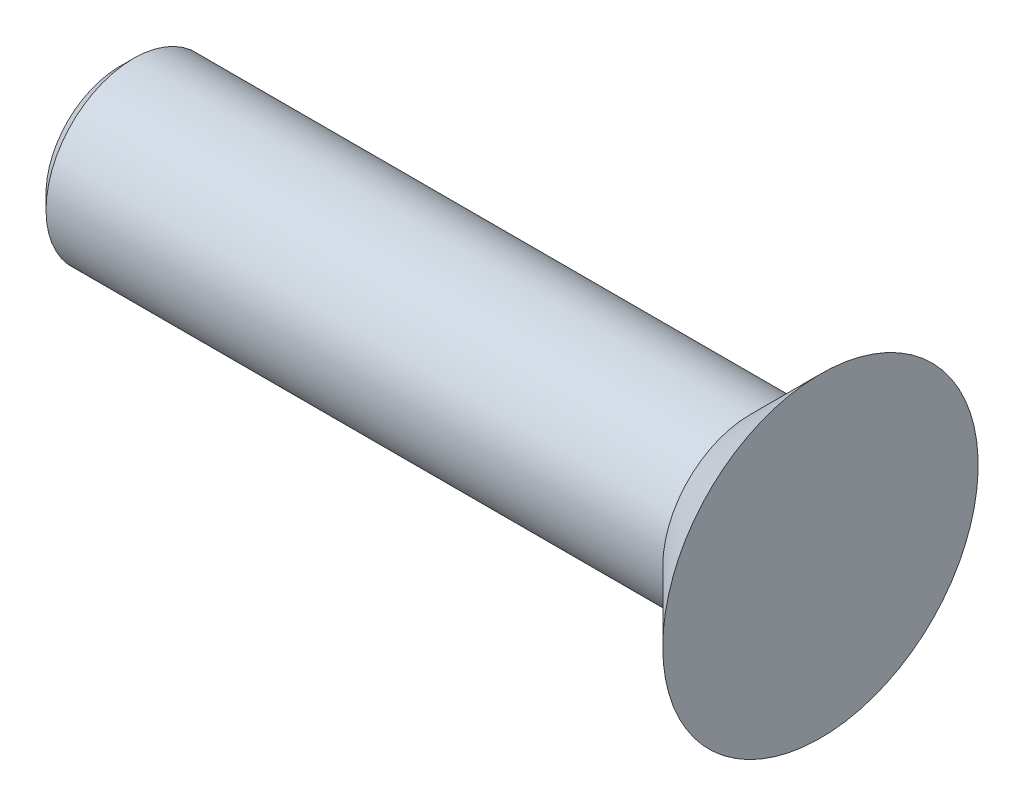
ISO-10303-21;
HEADER;
FILE_DESCRIPTION(('STEP AP214'),'2;1');
FILE_NAME('part.step','',(''),(''),'','','');
FILE_SCHEMA(('AUTOMOTIVE_DESIGN { 1 0 10303 214 1 1 1 1 }'));
ENDSEC;
DATA;
#1=APPLICATION_CONTEXT('core data for automotive mechanical design processes');
#2=APPLICATION_PROTOCOL_DEFINITION('international standard','automotive_design',2000,#1);
#3=PRODUCT_CONTEXT('',#1,'mechanical');
#4=PRODUCT('Part','Part','',(#3));
#5=PRODUCT_RELATED_PRODUCT_CATEGORY('part','',(#4));
#6=PRODUCT_DEFINITION_FORMATION('','',#4);
#7=PRODUCT_DEFINITION_CONTEXT('part definition',#1,'design');
#8=PRODUCT_DEFINITION('design','',#6,#7);
#9=PRODUCT_DEFINITION_SHAPE('','',#8);
#10=(LENGTH_UNIT() NAMED_UNIT(*) SI_UNIT(.MILLI.,.METRE.));
#11=(NAMED_UNIT(*) PLANE_ANGLE_UNIT() SI_UNIT($,.RADIAN.));
#12=(NAMED_UNIT(*) SI_UNIT($,.STERADIAN.) SOLID_ANGLE_UNIT());
#13=UNCERTAINTY_MEASURE_WITH_UNIT(LENGTH_MEASURE(1.E-05),#10,'distance_accuracy_value','');
#14=(GEOMETRIC_REPRESENTATION_CONTEXT(3) GLOBAL_UNCERTAINTY_ASSIGNED_CONTEXT((#13)) GLOBAL_UNIT_ASSIGNED_CONTEXT((#10,
#11,#12)) REPRESENTATION_CONTEXT('',''));
#15=CARTESIAN_POINT('',(0.,0.,0.));
#16=DIRECTION('',(0.,0.,1.));
#17=DIRECTION('',(1.,0.,0.));
#18=AXIS2_PLACEMENT_3D('',#15,#16,#17);
#19=CARTESIAN_POINT('',(0.,4.49999999999998,0.));
#20=DIRECTION('',(-1.,0.,0.));
#21=DIRECTION('',(0.,0.,1.));
#22=AXIS2_PLACEMENT_3D('',#19,#20,#21);
#23=PLANE('',#22);
#24=CARTESIAN_POINT('',(0.,0.,0.));
#25=DIRECTION('',(-1.,0.,0.));
#26=DIRECTION('',(0.,0.,1.));
#27=AXIS2_PLACEMENT_3D('',#24,#25,#26);
#28=CIRCLE('',#27,4.49999999999998);
#29=CARTESIAN_POINT('',(0.,0.,4.49999999999998));
#30=VERTEX_POINT('',#29);
#31=EDGE_CURVE('E34',#30,#30,#28,.T.);
#32=ORIENTED_EDGE('',*,*,#31,.F.);
#33=EDGE_LOOP('',(#32));
#34=FACE_BOUND('',#33,.T.);
#35=ADVANCED_FACE('F24',(#34),#23,.F.);
#36=CARTESIAN_POINT('',(0.,0.,0.));
#37=DIRECTION('',(1.,0.,0.));
#38=DIRECTION('',(0.,0.,-1.));
#39=AXIS2_PLACEMENT_3D('',#36,#37,#38);
#40=CONICAL_SURFACE('',#39,4.49999999999998,0.785398163397443);
#41=CARTESIAN_POINT('',(-2.,0.,0.));
#42=DIRECTION('',(-1.,0.,0.));
#43=DIRECTION('',(0.,0.,1.));
#44=AXIS2_PLACEMENT_3D('',#41,#42,#43);
#45=CIRCLE('',#44,2.5);
#46=CARTESIAN_POINT('',(-2.,0.,2.5));
#47=VERTEX_POINT('',#46);
#48=EDGE_CURVE('E38',#47,#47,#45,.T.);
#49=ORIENTED_EDGE('',*,*,#48,.F.);
#50=EDGE_LOOP('',(#49));
#51=FACE_BOUND('',#50,.T.);
#52=ORIENTED_EDGE('',*,*,#31,.T.);
#53=EDGE_LOOP('',(#52));
#54=FACE_BOUND('',#53,.T.);
#55=ADVANCED_FACE('F46',(#51,#54),#40,.T.);
#56=CARTESIAN_POINT('',(0.,0.,0.));
#57=DIRECTION('',(-1.,0.,0.));
#58=DIRECTION('',(0.,0.,1.));
#59=AXIS2_PLACEMENT_3D('',#56,#57,#58);
#60=CYLINDRICAL_SURFACE('',#59,2.5);
#61=CARTESIAN_POINT('',(-19.6,0.,0.));
#62=DIRECTION('',(1.,0.,0.));
#63=DIRECTION('',(0.,0.,-1.));
#64=AXIS2_PLACEMENT_3D('',#61,#62,#63);
#65=CIRCLE('',#64,2.5);
#66=CARTESIAN_POINT('',(-19.6,0.,-2.5));
#67=VERTEX_POINT('',#66);
#68=EDGE_CURVE('E10',#67,#67,#65,.T.);
#69=ORIENTED_EDGE('',*,*,#68,.T.);
#70=EDGE_LOOP('',(#69));
#71=FACE_BOUND('',#70,.T.);
#72=ORIENTED_EDGE('',*,*,#48,.T.);
#73=EDGE_LOOP('',(#72));
#74=FACE_BOUND('',#73,.T.);
#75=ADVANCED_FACE('F44',(#71,#74),#60,.T.);
#76=CARTESIAN_POINT('',(-20.,0.,0.));
#77=DIRECTION('',(1.,0.,0.));
#78=DIRECTION('',(0.,0.,-1.));
#79=AXIS2_PLACEMENT_3D('',#76,#77,#78);
#80=PLANE('',#79);
#81=CARTESIAN_POINT('',(-20.,0.,0.));
#82=DIRECTION('',(1.,0.,0.));
#83=DIRECTION('',(0.,0.,-1.));
#84=AXIS2_PLACEMENT_3D('',#81,#82,#83);
#85=CIRCLE('',#84,2.1);
#86=CARTESIAN_POINT('',(-20.,0.,-2.1));
#87=VERTEX_POINT('',#86);
#88=EDGE_CURVE('E30',#87,#87,#85,.F.);
#89=ORIENTED_EDGE('',*,*,#88,.T.);
#90=EDGE_LOOP('',(#89));
#91=FACE_BOUND('',#90,.T.);
#92=ADVANCED_FACE('F64',(#91),#80,.F.);
#93=CARTESIAN_POINT('',(-20.,0.,0.));
#94=DIRECTION('',(1.,0.,0.));
#95=DIRECTION('',(0.,0.,-1.));
#96=AXIS2_PLACEMENT_3D('',#93,#94,#95);
#97=CONICAL_SURFACE('',#96,2.1,0.785398163397441);
#98=ORIENTED_EDGE('',*,*,#68,.F.);
#99=EDGE_LOOP('',(#98));
#100=FACE_BOUND('',#99,.T.);
#101=ORIENTED_EDGE('',*,*,#88,.F.);
#102=EDGE_LOOP('',(#101));
#103=FACE_BOUND('',#102,.T.);
#104=ADVANCED_FACE('F71',(#100,#103),#97,.T.);
#105=CLOSED_SHELL('',(#35,#55,#75,#92,#104));
#106=MANIFOLD_SOLID_BREP('B2',#105);
#107=ADVANCED_BREP_SHAPE_REPRESENTATION('',(#18,#106),#14);
#108=SHAPE_DEFINITION_REPRESENTATION(#9,#107);
ENDSEC;
END-ISO-10303-21;
